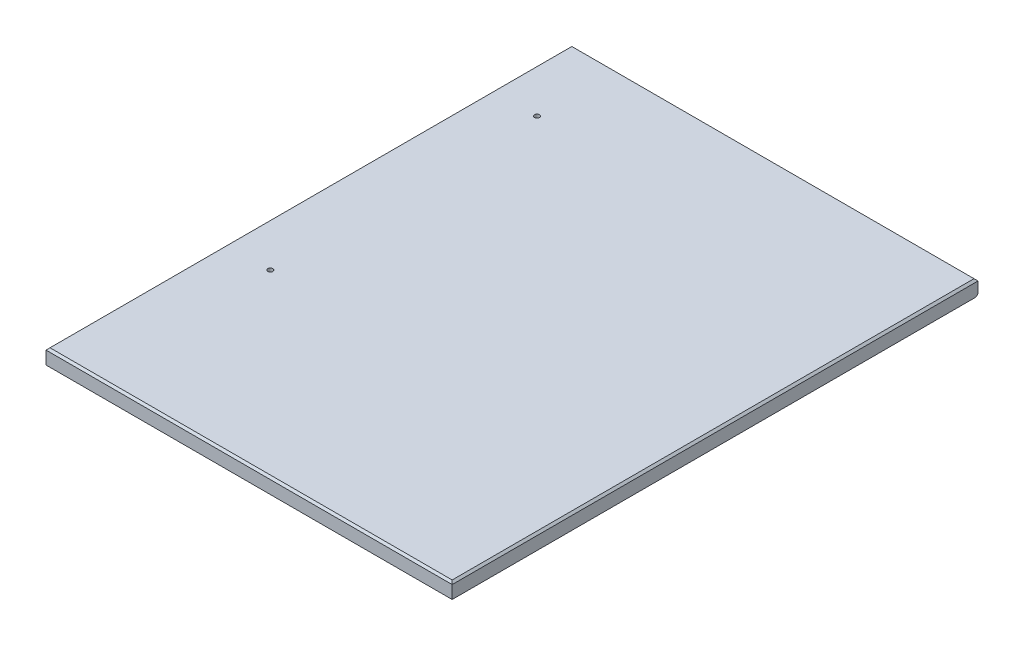
ISO-10303-21;
HEADER;
FILE_DESCRIPTION(('STEP AP214'),'2;1');
FILE_NAME('part.step','',(''),(''),'','','');
FILE_SCHEMA(('AUTOMOTIVE_DESIGN { 1 0 10303 214 1 1 1 1 }'));
ENDSEC;
DATA;
#1=APPLICATION_CONTEXT('core data for automotive mechanical design processes');
#2=APPLICATION_PROTOCOL_DEFINITION('international standard','automotive_design',2000,#1);
#3=PRODUCT_CONTEXT('',#1,'mechanical');
#4=PRODUCT('Part','Part','',(#3));
#5=PRODUCT_RELATED_PRODUCT_CATEGORY('part','',(#4));
#6=PRODUCT_DEFINITION_FORMATION('','',#4);
#7=PRODUCT_DEFINITION_CONTEXT('part definition',#1,'design');
#8=PRODUCT_DEFINITION('design','',#6,#7);
#9=PRODUCT_DEFINITION_SHAPE('','',#8);
#10=(LENGTH_UNIT() NAMED_UNIT(*) SI_UNIT(.MILLI.,.METRE.));
#11=(NAMED_UNIT(*) PLANE_ANGLE_UNIT() SI_UNIT($,.RADIAN.));
#12=(NAMED_UNIT(*) SI_UNIT($,.STERADIAN.) SOLID_ANGLE_UNIT());
#13=UNCERTAINTY_MEASURE_WITH_UNIT(LENGTH_MEASURE(1.E-05),#10,'distance_accuracy_value','');
#14=(GEOMETRIC_REPRESENTATION_CONTEXT(3) GLOBAL_UNCERTAINTY_ASSIGNED_CONTEXT((#13)) GLOBAL_UNIT_ASSIGNED_CONTEXT((#10,
#11,#12)) REPRESENTATION_CONTEXT('',''));
#15=CARTESIAN_POINT('',(0.,0.,0.));
#16=DIRECTION('',(0.,0.,1.));
#17=DIRECTION('',(1.,0.,0.));
#18=AXIS2_PLACEMENT_3D('',#15,#16,#17);
#19=CARTESIAN_POINT('',(0.,19.05,0.));
#20=DIRECTION('',(1.,0.,0.));
#21=DIRECTION('',(0.,0.,-1.));
#22=AXIS2_PLACEMENT_3D('',#19,#20,#21);
#23=PLANE('',#22);
#24=DIRECTION('',(0.,-1.,0.));
#25=VECTOR('',#24,1.);
#26=CARTESIAN_POINT('',(0.,19.05,-669.925));
#27=LINE('',#26,#25);
#28=CARTESIAN_POINT('',(0.,16.51,-669.925));
#29=VERTEX_POINT('',#28);
#30=CARTESIAN_POINT('',(0.,2.53999999999988,-669.925));
#31=VERTEX_POINT('',#30);
#32=EDGE_CURVE('E118',#29,#31,#27,.T.);
#33=ORIENTED_EDGE('',*,*,#32,.T.);
#34=DIRECTION('',(0.,-0.707106781186548,0.707106781186548));
#35=VECTOR('',#34,1.);
#36=CARTESIAN_POINT('',(0.,2.53999999999988,-669.925));
#37=LINE('',#36,#35);
#38=CARTESIAN_POINT('',(0.,0.,-667.385));
#39=VERTEX_POINT('',#38);
#40=EDGE_CURVE('E64',#31,#39,#37,.T.);
#41=ORIENTED_EDGE('',*,*,#40,.T.);
#42=DIRECTION('',(0.,0.,1.));
#43=VECTOR('',#42,1.);
#44=CARTESIAN_POINT('',(0.,0.,0.));
#45=LINE('',#44,#43);
#46=CARTESIAN_POINT('',(0.,0.,0.));
#47=VERTEX_POINT('',#46);
#48=EDGE_CURVE('E98',#39,#47,#45,.T.);
#49=ORIENTED_EDGE('',*,*,#48,.T.);
#50=DIRECTION('',(0.,-1.,0.));
#51=VECTOR('',#50,1.);
#52=CARTESIAN_POINT('',(0.,19.05,0.));
#53=LINE('',#52,#51);
#54=CARTESIAN_POINT('',(0.,16.51,0.));
#55=VERTEX_POINT('',#54);
#56=EDGE_CURVE('E100',#55,#47,#53,.T.);
#57=ORIENTED_EDGE('',*,*,#56,.F.);
#58=DIRECTION('',(0.,0.,-1.));
#59=VECTOR('',#58,1.);
#60=CARTESIAN_POINT('',(0.,16.51,0.));
#61=LINE('',#60,#59);
#62=EDGE_CURVE('E141',#55,#29,#61,.T.);
#63=ORIENTED_EDGE('',*,*,#62,.T.);
#64=EDGE_LOOP('',(#33,#41,#49,#57,#63));
#65=FACE_BOUND('',#64,.T.);
#66=ADVANCED_FACE('F41',(#65),#23,.F.);
#67=CARTESIAN_POINT('',(0.,19.05,0.));
#68=DIRECTION('',(0.,0.,-1.));
#69=DIRECTION('',(-1.,0.,0.));
#70=AXIS2_PLACEMENT_3D('',#67,#68,#69);
#71=PLANE('',#70);
#72=DIRECTION('',(0.,-1.,0.));
#73=VECTOR('',#72,1.);
#74=CARTESIAN_POINT('',(517.4488,19.05,0.));
#75=LINE('',#74,#73);
#76=CARTESIAN_POINT('',(517.4488,16.51,0.));
#77=VERTEX_POINT('',#76);
#78=CARTESIAN_POINT('',(517.4488,0.,0.));
#79=VERTEX_POINT('',#78);
#80=EDGE_CURVE('E113',#77,#79,#75,.T.);
#81=ORIENTED_EDGE('',*,*,#80,.F.);
#82=DIRECTION('',(-1.,0.,0.));
#83=VECTOR('',#82,1.);
#84=CARTESIAN_POINT('',(0.,16.51,0.));
#85=LINE('',#84,#83);
#86=EDGE_CURVE('E111',#77,#55,#85,.T.);
#87=ORIENTED_EDGE('',*,*,#86,.T.);
#88=ORIENTED_EDGE('',*,*,#56,.T.);
#89=DIRECTION('',(1.,0.,0.));
#90=VECTOR('',#89,1.);
#91=CARTESIAN_POINT('',(0.,0.,0.));
#92=LINE('',#91,#90);
#93=EDGE_CURVE('E103',#47,#79,#92,.T.);
#94=ORIENTED_EDGE('',*,*,#93,.T.);
#95=EDGE_LOOP('',(#81,#87,#88,#94));
#96=FACE_BOUND('',#95,.T.);
#97=ADVANCED_FACE('F109',(#96),#71,.F.);
#98=CARTESIAN_POINT('',(517.4488,19.05,0.));
#99=DIRECTION('',(-1.,0.,0.));
#100=DIRECTION('',(0.,0.,1.));
#101=AXIS2_PLACEMENT_3D('',#98,#99,#100);
#102=PLANE('',#101);
#103=DIRECTION('',(0.,0.,-1.));
#104=VECTOR('',#103,1.);
#105=CARTESIAN_POINT('',(517.4488,0.,0.));
#106=LINE('',#105,#104);
#107=CARTESIAN_POINT('',(517.4488,0.,-667.385));
#108=VERTEX_POINT('',#107);
#109=EDGE_CURVE('E116',#79,#108,#106,.T.);
#110=ORIENTED_EDGE('',*,*,#109,.T.);
#111=DIRECTION('',(0.,0.707106781186548,-0.707106781186548));
#112=VECTOR('',#111,1.);
#113=CARTESIAN_POINT('',(517.4488,2.53999999999988,-669.925));
#114=LINE('',#113,#112);
#115=CARTESIAN_POINT('',(517.4488,2.53999999999988,-669.925));
#116=VERTEX_POINT('',#115);
#117=EDGE_CURVE('E11',#108,#116,#114,.T.);
#118=ORIENTED_EDGE('',*,*,#117,.T.);
#119=DIRECTION('',(0.,-1.,0.));
#120=VECTOR('',#119,1.);
#121=CARTESIAN_POINT('',(517.4488,19.05,-669.925));
#122=LINE('',#121,#120);
#123=CARTESIAN_POINT('',(517.4488,16.51,-669.925));
#124=VERTEX_POINT('',#123);
#125=EDGE_CURVE('E123',#124,#116,#122,.T.);
#126=ORIENTED_EDGE('',*,*,#125,.F.);
#127=DIRECTION('',(0.,0.,1.));
#128=VECTOR('',#127,1.);
#129=CARTESIAN_POINT('',(517.4488,16.51,0.));
#130=LINE('',#129,#128);
#131=EDGE_CURVE('E138',#124,#77,#130,.T.);
#132=ORIENTED_EDGE('',*,*,#131,.T.);
#133=ORIENTED_EDGE('',*,*,#80,.T.);
#134=EDGE_LOOP('',(#110,#118,#126,#132,#133));
#135=FACE_BOUND('',#134,.T.);
#136=ADVANCED_FACE('F175',(#135),#102,.F.);
#137=CARTESIAN_POINT('',(0.,19.05,-669.925));
#138=DIRECTION('',(0.,0.,1.));
#139=DIRECTION('',(1.,0.,0.));
#140=AXIS2_PLACEMENT_3D('',#137,#138,#139);
#141=PLANE('',#140);
#142=ORIENTED_EDGE('',*,*,#125,.T.);
#143=DIRECTION('',(-1.,0.,0.));
#144=VECTOR('',#143,1.);
#145=CARTESIAN_POINT('',(0.,2.53999999999988,-669.925));
#146=LINE('',#145,#144);
#147=EDGE_CURVE('E143',#116,#31,#146,.T.);
#148=ORIENTED_EDGE('',*,*,#147,.T.);
#149=ORIENTED_EDGE('',*,*,#32,.F.);
#150=DIRECTION('',(1.,0.,0.));
#151=VECTOR('',#150,1.);
#152=CARTESIAN_POINT('',(0.,16.51,-669.925));
#153=LINE('',#152,#151);
#154=EDGE_CURVE('E135',#29,#124,#153,.T.);
#155=ORIENTED_EDGE('',*,*,#154,.T.);
#156=EDGE_LOOP('',(#142,#148,#149,#155));
#157=FACE_BOUND('',#156,.T.);
#158=ADVANCED_FACE('F159',(#157),#141,.F.);
#159=CARTESIAN_POINT('',(0.,19.05,0.));
#160=DIRECTION('',(0.,-1.,0.));
#161=DIRECTION('',(0.,0.,-1.));
#162=AXIS2_PLACEMENT_3D('',#159,#160,#161);
#163=PLANE('',#162);
#164=CARTESIAN_POINT('',(57.15,19.05,-228.6));
#165=DIRECTION('',(0.,1.,0.));
#166=DIRECTION('',(0.,0.,1.));
#167=AXIS2_PLACEMENT_3D('',#164,#165,#166);
#168=CIRCLE('',#167,3.175);
#169=CARTESIAN_POINT('',(57.15,19.05,-225.425));
#170=VERTEX_POINT('',#169);
#171=EDGE_CURVE('E302',#170,#170,#168,.T.);
#172=ORIENTED_EDGE('',*,*,#171,.F.);
#173=EDGE_LOOP('',(#172));
#174=FACE_BOUND('',#173,.T.);
#175=CARTESIAN_POINT('',(57.1499999999999,19.05,-568.325));
#176=DIRECTION('',(0.,1.,0.));
#177=DIRECTION('',(0.,0.,1.));
#178=AXIS2_PLACEMENT_3D('',#175,#176,#177);
#179=CIRCLE('',#178,3.175);
#180=CARTESIAN_POINT('',(57.1499999999999,19.05,-565.15));
#181=VERTEX_POINT('',#180);
#182=EDGE_CURVE('E303',#181,#181,#179,.T.);
#183=ORIENTED_EDGE('',*,*,#182,.F.);
#184=EDGE_LOOP('',(#183));
#185=FACE_BOUND('',#184,.T.);
#186=DIRECTION('',(0.,0.,-1.));
#187=VECTOR('',#186,1.);
#188=CARTESIAN_POINT('',(514.9088,19.05,0.));
#189=LINE('',#188,#187);
#190=CARTESIAN_POINT('',(514.9088,19.05,-2.53999999999987));
#191=VERTEX_POINT('',#190);
#192=CARTESIAN_POINT('',(514.9088,19.05,-667.385));
#193=VERTEX_POINT('',#192);
#194=EDGE_CURVE('E130',#191,#193,#189,.T.);
#195=ORIENTED_EDGE('',*,*,#194,.T.);
#196=DIRECTION('',(-1.,0.,0.));
#197=VECTOR('',#196,1.);
#198=CARTESIAN_POINT('',(0.,19.05,-667.385));
#199=LINE('',#198,#197);
#200=CARTESIAN_POINT('',(2.53999999999987,19.05,-667.385));
#201=VERTEX_POINT('',#200);
#202=EDGE_CURVE('E132',#193,#201,#199,.T.);
#203=ORIENTED_EDGE('',*,*,#202,.T.);
#204=DIRECTION('',(0.,0.,1.));
#205=VECTOR('',#204,1.);
#206=CARTESIAN_POINT('',(2.53999999999987,19.05,0.));
#207=LINE('',#206,#205);
#208=CARTESIAN_POINT('',(2.53999999999987,19.05,-2.53999999999987));
#209=VERTEX_POINT('',#208);
#210=EDGE_CURVE('E112',#201,#209,#207,.T.);
#211=ORIENTED_EDGE('',*,*,#210,.T.);
#212=DIRECTION('',(1.,0.,0.));
#213=VECTOR('',#212,1.);
#214=CARTESIAN_POINT('',(0.,19.05,-2.53999999999987));
#215=LINE('',#214,#213);
#216=EDGE_CURVE('E128',#209,#191,#215,.T.);
#217=ORIENTED_EDGE('',*,*,#216,.T.);
#218=EDGE_LOOP('',(#195,#203,#211,#217));
#219=FACE_BOUND('',#218,.T.);
#220=ADVANCED_FACE('F220',(#174,#185,#219),#163,.F.);
#221=CARTESIAN_POINT('',(0.,0.,0.));
#222=DIRECTION('',(0.,-1.,0.));
#223=DIRECTION('',(0.,0.,-1.));
#224=AXIS2_PLACEMENT_3D('',#221,#222,#223);
#225=PLANE('',#224);
#226=CARTESIAN_POINT('',(57.15,0.,-228.6));
#227=DIRECTION('',(0.,1.,0.));
#228=DIRECTION('',(0.,0.,1.));
#229=AXIS2_PLACEMENT_3D('',#226,#227,#228);
#230=CIRCLE('',#229,3.175);
#231=CARTESIAN_POINT('',(57.15,0.,-225.425));
#232=VERTEX_POINT('',#231);
#233=EDGE_CURVE('E300',#232,#232,#230,.T.);
#234=ORIENTED_EDGE('',*,*,#233,.T.);
#235=EDGE_LOOP('',(#234));
#236=FACE_BOUND('',#235,.T.);
#237=CARTESIAN_POINT('',(57.1499999999999,0.,-568.325));
#238=DIRECTION('',(0.,1.,0.));
#239=DIRECTION('',(0.,0.,1.));
#240=AXIS2_PLACEMENT_3D('',#237,#238,#239);
#241=CIRCLE('',#240,3.175);
#242=CARTESIAN_POINT('',(57.1499999999999,0.,-565.15));
#243=VERTEX_POINT('',#242);
#244=EDGE_CURVE('E147',#243,#243,#241,.T.);
#245=ORIENTED_EDGE('',*,*,#244,.T.);
#246=EDGE_LOOP('',(#245));
#247=FACE_BOUND('',#246,.T.);
#248=ORIENTED_EDGE('',*,*,#48,.F.);
#249=DIRECTION('',(1.,0.,0.));
#250=VECTOR('',#249,1.);
#251=CARTESIAN_POINT('',(517.4488,0.,-667.385));
#252=LINE('',#251,#250);
#253=EDGE_CURVE('E50',#39,#108,#252,.T.);
#254=ORIENTED_EDGE('',*,*,#253,.T.);
#255=ORIENTED_EDGE('',*,*,#109,.F.);
#256=ORIENTED_EDGE('',*,*,#93,.F.);
#257=EDGE_LOOP('',(#248,#254,#255,#256));
#258=FACE_BOUND('',#257,.T.);
#259=ADVANCED_FACE('F115',(#236,#247,#258),#225,.T.);
#260=CARTESIAN_POINT('',(0.,19.05,-2.53999999999987));
#261=DIRECTION('',(0.,-0.707106781186532,-0.707106781186563));
#262=DIRECTION('',(1.,0.,0.));
#263=AXIS2_PLACEMENT_3D('',#260,#261,#262);
#264=PLANE('',#263);
#265=DIRECTION('',(0.577350269189617,0.577350269189643,-0.577350269189617));
#266=VECTOR('',#265,1.);
#267=CARTESIAN_POINT('',(1.69333333333327,18.2033333333334,-1.69333333333327));
#268=LINE('',#267,#266);
#269=EDGE_CURVE('E149',#55,#209,#268,.T.);
#270=ORIENTED_EDGE('',*,*,#269,.F.);
#271=ORIENTED_EDGE('',*,*,#86,.F.);
#272=DIRECTION('',(-0.577350269189617,0.577350269189643,-0.577350269189617));
#273=VECTOR('',#272,1.);
#274=CARTESIAN_POINT('',(343.272533333338,190.686266666669,-174.176266666661));
#275=LINE('',#274,#273);
#276=EDGE_CURVE('E104',#191,#77,#275,.F.);
#277=ORIENTED_EDGE('',*,*,#276,.F.);
#278=ORIENTED_EDGE('',*,*,#216,.F.);
#279=EDGE_LOOP('',(#270,#271,#277,#278));
#280=FACE_BOUND('',#279,.T.);
#281=ADVANCED_FACE('F211',(#280),#264,.F.);
#282=CARTESIAN_POINT('',(514.9088,19.05,0.));
#283=DIRECTION('',(-0.707106781186563,-0.707106781186532,0.));
#284=DIRECTION('',(0.,0.,-1.));
#285=AXIS2_PLACEMENT_3D('',#282,#283,#284);
#286=PLANE('',#285);
#287=ORIENTED_EDGE('',*,*,#276,.T.);
#288=ORIENTED_EDGE('',*,*,#131,.F.);
#289=DIRECTION('',(-0.577350269189617,0.577350269189642,0.577350269189617));
#290=VECTOR('',#289,1.);
#291=CARTESIAN_POINT('',(292.44713333334,241.51166666667,-444.92333333334));
#292=LINE('',#291,#290);
#293=EDGE_CURVE('E146',#193,#124,#292,.F.);
#294=ORIENTED_EDGE('',*,*,#293,.F.);
#295=ORIENTED_EDGE('',*,*,#194,.F.);
#296=EDGE_LOOP('',(#287,#288,#294,#295));
#297=FACE_BOUND('',#296,.T.);
#298=ADVANCED_FACE('F206',(#297),#286,.F.);
#299=CARTESIAN_POINT('',(2.53999999999987,19.05,0.));
#300=DIRECTION('',(0.707106781186563,-0.707106781186532,0.));
#301=DIRECTION('',(0.,0.,1.));
#302=AXIS2_PLACEMENT_3D('',#299,#300,#301);
#303=PLANE('',#302);
#304=ORIENTED_EDGE('',*,*,#269,.T.);
#305=ORIENTED_EDGE('',*,*,#210,.F.);
#306=DIRECTION('',(-0.577350269189617,-0.577350269189643,-0.577350269189617));
#307=VECTOR('',#306,1.);
#308=CARTESIAN_POINT('',(225.00166666666,241.51166666667,-444.92333333334));
#309=LINE('',#308,#307);
#310=EDGE_CURVE('E144',#29,#201,#309,.F.);
#311=ORIENTED_EDGE('',*,*,#310,.F.);
#312=ORIENTED_EDGE('',*,*,#62,.F.);
#313=EDGE_LOOP('',(#304,#305,#311,#312));
#314=FACE_BOUND('',#313,.T.);
#315=ADVANCED_FACE('F167',(#314),#303,.F.);
#316=CARTESIAN_POINT('',(0.,19.05,-667.385));
#317=DIRECTION('',(0.,-0.707106781186532,0.707106781186563));
#318=DIRECTION('',(-1.,0.,0.));
#319=AXIS2_PLACEMENT_3D('',#316,#317,#318);
#320=PLANE('',#319);
#321=ORIENTED_EDGE('',*,*,#293,.T.);
#322=ORIENTED_EDGE('',*,*,#154,.F.);
#323=ORIENTED_EDGE('',*,*,#310,.T.);
#324=ORIENTED_EDGE('',*,*,#202,.F.);
#325=EDGE_LOOP('',(#321,#322,#323,#324));
#326=FACE_BOUND('',#325,.T.);
#327=ADVANCED_FACE('F171',(#326),#320,.F.);
#328=CARTESIAN_POINT('',(0.,2.53999999999988,-669.925));
#329=DIRECTION('',(0.,-0.707106781186548,-0.707106781186548));
#330=DIRECTION('',(1.,0.,0.));
#331=AXIS2_PLACEMENT_3D('',#328,#329,#330);
#332=PLANE('',#331);
#333=ORIENTED_EDGE('',*,*,#117,.F.);
#334=ORIENTED_EDGE('',*,*,#253,.F.);
#335=ORIENTED_EDGE('',*,*,#40,.F.);
#336=ORIENTED_EDGE('',*,*,#147,.F.);
#337=EDGE_LOOP('',(#333,#334,#335,#336));
#338=FACE_BOUND('',#337,.T.);
#339=ADVANCED_FACE('F44',(#338),#332,.T.);
#340=CARTESIAN_POINT('',(57.1499999999999,0.,-568.325));
#341=DIRECTION('',(0.,1.,0.));
#342=DIRECTION('',(0.,0.,1.));
#343=AXIS2_PLACEMENT_3D('',#340,#341,#342);
#344=CYLINDRICAL_SURFACE('',#343,3.175);
#345=ORIENTED_EDGE('',*,*,#244,.F.);
#346=EDGE_LOOP('',(#345));
#347=FACE_BOUND('',#346,.T.);
#348=ORIENTED_EDGE('',*,*,#182,.T.);
#349=EDGE_LOOP('',(#348));
#350=FACE_BOUND('',#349,.T.);
#351=ADVANCED_FACE('F177',(#347,#350),#344,.F.);
#352=CARTESIAN_POINT('',(57.15,0.,-228.6));
#353=DIRECTION('',(0.,1.,0.));
#354=DIRECTION('',(0.,0.,1.));
#355=AXIS2_PLACEMENT_3D('',#352,#353,#354);
#356=CYLINDRICAL_SURFACE('',#355,3.175);
#357=ORIENTED_EDGE('',*,*,#233,.F.);
#358=EDGE_LOOP('',(#357));
#359=FACE_BOUND('',#358,.T.);
#360=ORIENTED_EDGE('',*,*,#171,.T.);
#361=EDGE_LOOP('',(#360));
#362=FACE_BOUND('',#361,.T.);
#363=ADVANCED_FACE('F183',(#359,#362),#356,.F.);
#364=CLOSED_SHELL('',(#66,#97,#136,#158,#220,#259,#281,#298,#315,#327,#339,#351,#363));
#365=MANIFOLD_SOLID_BREP('B2',#364);
#366=ADVANCED_BREP_SHAPE_REPRESENTATION('',(#18,#365),#14);
#367=SHAPE_DEFINITION_REPRESENTATION(#9,#366);
ENDSEC;
END-ISO-10303-21;
